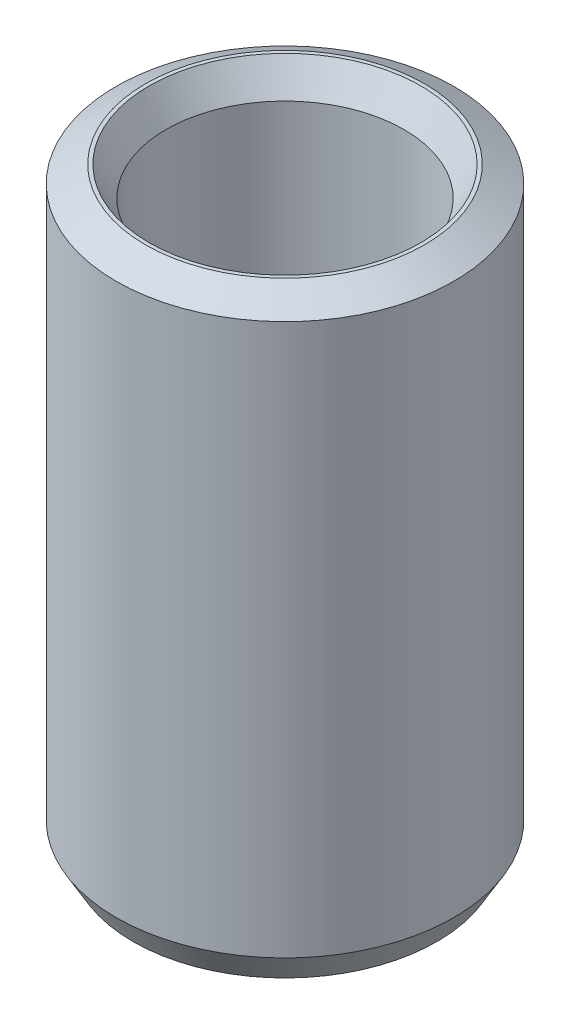
ISO-10303-21;
HEADER;
FILE_DESCRIPTION(('STEP AP214'),'2;1');
FILE_NAME('part.step','',(''),(''),'','','');
FILE_SCHEMA(('AUTOMOTIVE_DESIGN { 1 0 10303 214 1 1 1 1 }'));
ENDSEC;
DATA;
#1=APPLICATION_CONTEXT('core data for automotive mechanical design processes');
#2=APPLICATION_PROTOCOL_DEFINITION('international standard','automotive_design',2000,#1);
#3=PRODUCT_CONTEXT('',#1,'mechanical');
#4=PRODUCT('Part','Part','',(#3));
#5=PRODUCT_RELATED_PRODUCT_CATEGORY('part','',(#4));
#6=PRODUCT_DEFINITION_FORMATION('','',#4);
#7=PRODUCT_DEFINITION_CONTEXT('part definition',#1,'design');
#8=PRODUCT_DEFINITION('design','',#6,#7);
#9=PRODUCT_DEFINITION_SHAPE('','',#8);
#10=(LENGTH_UNIT() NAMED_UNIT(*) SI_UNIT(.MILLI.,.METRE.));
#11=(NAMED_UNIT(*) PLANE_ANGLE_UNIT() SI_UNIT($,.RADIAN.));
#12=(NAMED_UNIT(*) SI_UNIT($,.STERADIAN.) SOLID_ANGLE_UNIT());
#13=UNCERTAINTY_MEASURE_WITH_UNIT(LENGTH_MEASURE(1.E-05),#10,'distance_accuracy_value','');
#14=(GEOMETRIC_REPRESENTATION_CONTEXT(3) GLOBAL_UNCERTAINTY_ASSIGNED_CONTEXT((#13)) GLOBAL_UNIT_ASSIGNED_CONTEXT((#10,
#11,#12)) REPRESENTATION_CONTEXT('',''));
#15=CARTESIAN_POINT('',(0.,0.,0.));
#16=DIRECTION('',(0.,0.,1.));
#17=DIRECTION('',(1.,0.,0.));
#18=AXIS2_PLACEMENT_3D('',#15,#16,#17);
#19=CARTESIAN_POINT('',(0.,53.0628774473187,0.));
#20=DIRECTION('',(0.,-1.,0.));
#21=DIRECTION('',(0.,0.,-1.));
#22=AXIS2_PLACEMENT_3D('',#19,#20,#21);
#23=CYLINDRICAL_SURFACE('',#22,15.);
#24=CARTESIAN_POINT('',(0.,2.60452820181144,0.));
#25=DIRECTION('',(0.,1.,0.));
#26=DIRECTION('',(0.,0.,1.));
#27=AXIS2_PLACEMENT_3D('',#24,#25,#26);
#28=CIRCLE('',#27,15.);
#29=CARTESIAN_POINT('',(0.,2.60452820181144,15.));
#30=VERTEX_POINT('',#29);
#31=EDGE_CURVE('E10',#30,#30,#28,.T.);
#32=ORIENTED_EDGE('',*,*,#31,.T.);
#33=EDGE_LOOP('',(#32));
#34=FACE_BOUND('',#33,.T.);
#35=CARTESIAN_POINT('',(0.,51.5591523888909,0.));
#36=DIRECTION('',(0.,1.,0.));
#37=DIRECTION('',(0.,0.,1.));
#38=AXIS2_PLACEMENT_3D('',#35,#36,#37);
#39=CIRCLE('',#38,15.);
#40=CARTESIAN_POINT('',(0.,51.5591523888909,15.));
#41=VERTEX_POINT('',#40);
#42=EDGE_CURVE('E50',#41,#41,#39,.F.);
#43=ORIENTED_EDGE('',*,*,#42,.T.);
#44=EDGE_LOOP('',(#43));
#45=FACE_BOUND('',#44,.T.);
#46=ADVANCED_FACE('F39',(#34,#45),#23,.T.);
#47=CARTESIAN_POINT('',(0.,53.0628774473187,0.));
#48=DIRECTION('',(0.,1.,0.));
#49=DIRECTION('',(0.,0.,1.));
#50=AXIS2_PLACEMENT_3D('',#47,#48,#49);
#51=PLANE('',#50);
#52=CARTESIAN_POINT('',(0.,53.0628774473187,0.));
#53=DIRECTION('',(0.,1.,0.));
#54=DIRECTION('',(0.,0.,1.));
#55=AXIS2_PLACEMENT_3D('',#52,#53,#54);
#56=CIRCLE('',#55,12.0708929483573);
#57=CARTESIAN_POINT('',(0.,53.0628774473187,12.0708929483573));
#58=VERTEX_POINT('',#57);
#59=EDGE_CURVE('E58',#58,#58,#56,.F.);
#60=ORIENTED_EDGE('',*,*,#59,.T.);
#61=EDGE_LOOP('',(#60));
#62=FACE_BOUND('',#61,.T.);
#63=CARTESIAN_POINT('',(0.,53.0628774473187,0.));
#64=DIRECTION('',(0.,1.,0.));
#65=DIRECTION('',(0.,0.,1.));
#66=AXIS2_PLACEMENT_3D('',#63,#64,#65);
#67=CIRCLE('',#66,12.3954717981885);
#68=CARTESIAN_POINT('',(0.,53.0628774473187,12.3954717981885));
#69=VERTEX_POINT('',#68);
#70=EDGE_CURVE('E61',#69,#69,#67,.T.);
#71=ORIENTED_EDGE('',*,*,#70,.T.);
#72=EDGE_LOOP('',(#71));
#73=FACE_BOUND('',#72,.T.);
#74=ADVANCED_FACE('F88',(#62,#73),#51,.T.);
#75=CARTESIAN_POINT('',(0.,0.,0.));
#76=DIRECTION('',(0.,1.,0.));
#77=DIRECTION('',(0.,0.,1.));
#78=AXIS2_PLACEMENT_3D('',#75,#76,#77);
#79=PLANE('',#78);
#80=CARTESIAN_POINT('',(0.,0.,0.));
#81=DIRECTION('',(0.,1.,0.));
#82=DIRECTION('',(0.,0.,1.));
#83=AXIS2_PLACEMENT_3D('',#80,#81,#82);
#84=CIRCLE('',#83,13.171696091741);
#85=CARTESIAN_POINT('',(0.,0.,13.171696091741));
#86=VERTEX_POINT('',#85);
#87=EDGE_CURVE('E51',#86,#86,#84,.T.);
#88=ORIENTED_EDGE('',*,*,#87,.T.);
#89=EDGE_LOOP('',(#88));
#90=FACE_BOUND('',#89,.T.);
#91=CARTESIAN_POINT('',(0.,0.,0.));
#92=DIRECTION('',(0.,1.,0.));
#93=DIRECTION('',(0.,0.,1.));
#94=AXIS2_PLACEMENT_3D('',#91,#92,#93);
#95=CIRCLE('',#94,13.4962749415722);
#96=CARTESIAN_POINT('',(0.,0.,13.4962749415722));
#97=VERTEX_POINT('',#96);
#98=EDGE_CURVE('E54',#97,#97,#95,.F.);
#99=ORIENTED_EDGE('',*,*,#98,.T.);
#100=EDGE_LOOP('',(#99));
#101=FACE_BOUND('',#100,.T.);
#102=ADVANCED_FACE('F83',(#90,#101),#79,.F.);
#103=CARTESIAN_POINT('',(0.,53.0628774473187,0.));
#104=DIRECTION('',(0.,-1.,0.));
#105=DIRECTION('',(0.,0.,-1.));
#106=AXIS2_PLACEMENT_3D('',#103,#104,#105);
#107=CYLINDRICAL_SURFACE('',#106,10.5671678899295);
#108=CARTESIAN_POINT('',(0.,50.4583492455073,0.));
#109=DIRECTION('',(0.,1.,0.));
#110=DIRECTION('',(0.,0.,1.));
#111=AXIS2_PLACEMENT_3D('',#108,#109,#110);
#112=CIRCLE('',#111,10.5671678899295);
#113=CARTESIAN_POINT('',(0.,50.4583492455073,10.5671678899295));
#114=VERTEX_POINT('',#113);
#115=EDGE_CURVE('E67',#114,#114,#112,.T.);
#116=ORIENTED_EDGE('',*,*,#115,.T.);
#117=EDGE_LOOP('',(#116));
#118=FACE_BOUND('',#117,.T.);
#119=CARTESIAN_POINT('',(0.,1.50372505842784,0.));
#120=DIRECTION('',(0.,1.,0.));
#121=DIRECTION('',(0.,0.,1.));
#122=AXIS2_PLACEMENT_3D('',#119,#120,#121);
#123=CIRCLE('',#122,10.5671678899295);
#124=CARTESIAN_POINT('',(0.,1.50372505842784,10.5671678899295));
#125=VERTEX_POINT('',#124);
#126=EDGE_CURVE('E69',#125,#125,#123,.F.);
#127=ORIENTED_EDGE('',*,*,#126,.T.);
#128=EDGE_LOOP('',(#127));
#129=FACE_BOUND('',#128,.T.);
#130=ADVANCED_FACE('F71',(#118,#129),#107,.F.);
#131=CARTESIAN_POINT('',(0.,50.4583492455073,0.));
#132=DIRECTION('',(0.,1.,0.));
#133=DIRECTION('',(0.,0.,1.));
#134=AXIS2_PLACEMENT_3D('',#131,#132,#133);
#135=CONICAL_SURFACE('',#134,10.5671678899295,0.523598775598304);
#136=ORIENTED_EDGE('',*,*,#59,.F.);
#137=EDGE_LOOP('',(#136));
#138=FACE_BOUND('',#137,.T.);
#139=ORIENTED_EDGE('',*,*,#115,.F.);
#140=EDGE_LOOP('',(#139));
#141=FACE_BOUND('',#140,.T.);
#142=ADVANCED_FACE('F77',(#138,#141),#135,.F.);
#143=CARTESIAN_POINT('',(0.,0.,0.));
#144=DIRECTION('',(0.,-1.,0.));
#145=DIRECTION('',(0.,0.,-1.));
#146=AXIS2_PLACEMENT_3D('',#143,#144,#145);
#147=CONICAL_SURFACE('',#146,13.171696091741,1.04719755119659);
#148=ORIENTED_EDGE('',*,*,#126,.F.);
#149=EDGE_LOOP('',(#148));
#150=FACE_BOUND('',#149,.T.);
#151=ORIENTED_EDGE('',*,*,#87,.F.);
#152=EDGE_LOOP('',(#151));
#153=FACE_BOUND('',#152,.T.);
#154=ADVANCED_FACE('F73',(#150,#153),#147,.F.);
#155=CARTESIAN_POINT('',(0.,2.60452820181144,0.));
#156=DIRECTION('',(0.,1.,0.));
#157=DIRECTION('',(0.,0.,1.));
#158=AXIS2_PLACEMENT_3D('',#155,#156,#157);
#159=CONICAL_SURFACE('',#158,15.,0.523598775598305);
#160=ORIENTED_EDGE('',*,*,#98,.F.);
#161=EDGE_LOOP('',(#160));
#162=FACE_BOUND('',#161,.T.);
#163=ORIENTED_EDGE('',*,*,#31,.F.);
#164=EDGE_LOOP('',(#163));
#165=FACE_BOUND('',#164,.T.);
#166=ADVANCED_FACE('F76',(#162,#165),#159,.T.);
#167=CARTESIAN_POINT('',(0.,53.0628774473187,0.));
#168=DIRECTION('',(0.,-1.,0.));
#169=DIRECTION('',(0.,0.,-1.));
#170=AXIS2_PLACEMENT_3D('',#167,#168,#169);
#171=CONICAL_SURFACE('',#170,12.3954717981885,1.04719755119659);
#172=ORIENTED_EDGE('',*,*,#42,.F.);
#173=EDGE_LOOP('',(#172));
#174=FACE_BOUND('',#173,.T.);
#175=ORIENTED_EDGE('',*,*,#70,.F.);
#176=EDGE_LOOP('',(#175));
#177=FACE_BOUND('',#176,.T.);
#178=ADVANCED_FACE('F45',(#174,#177),#171,.T.);
#179=CLOSED_SHELL('',(#46,#74,#102,#130,#142,#154,#166,#178));
#180=MANIFOLD_SOLID_BREP('B2',#179);
#181=ADVANCED_BREP_SHAPE_REPRESENTATION('',(#18,#180),#14);
#182=SHAPE_DEFINITION_REPRESENTATION(#9,#181);
ENDSEC;
END-ISO-10303-21;
